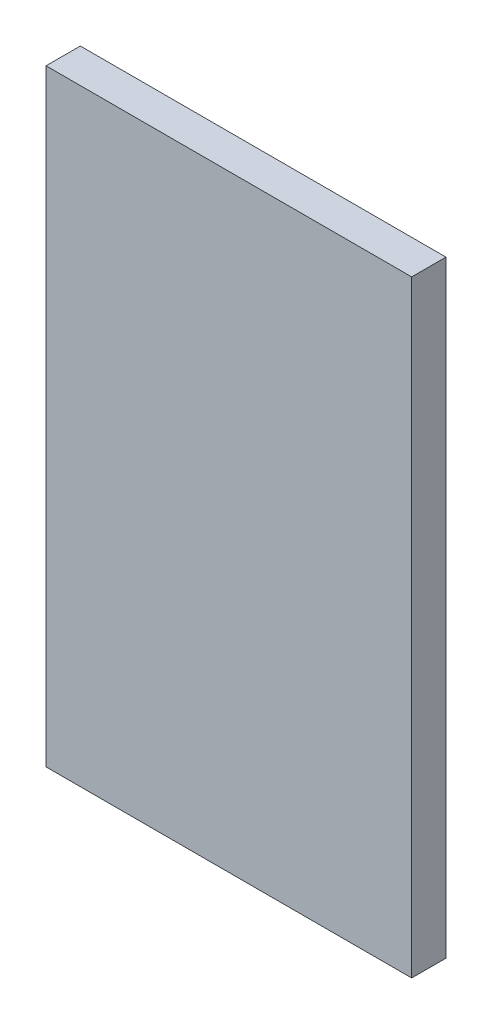
ISO-10303-21;
HEADER;
FILE_DESCRIPTION(('STEP AP214'),'2;1');
FILE_NAME('part.step','',(''),(''),'','','');
FILE_SCHEMA(('AUTOMOTIVE_DESIGN { 1 0 10303 214 1 1 1 1 }'));
ENDSEC;
DATA;
#1=APPLICATION_CONTEXT('core data for automotive mechanical design processes');
#2=APPLICATION_PROTOCOL_DEFINITION('international standard','automotive_design',2000,#1);
#3=PRODUCT_CONTEXT('',#1,'mechanical');
#4=PRODUCT('Part','Part','',(#3));
#5=PRODUCT_RELATED_PRODUCT_CATEGORY('part','',(#4));
#6=PRODUCT_DEFINITION_FORMATION('','',#4);
#7=PRODUCT_DEFINITION_CONTEXT('part definition',#1,'design');
#8=PRODUCT_DEFINITION('design','',#6,#7);
#9=PRODUCT_DEFINITION_SHAPE('','',#8);
#10=(LENGTH_UNIT() NAMED_UNIT(*) SI_UNIT(.MILLI.,.METRE.));
#11=(NAMED_UNIT(*) PLANE_ANGLE_UNIT() SI_UNIT($,.RADIAN.));
#12=(NAMED_UNIT(*) SI_UNIT($,.STERADIAN.) SOLID_ANGLE_UNIT());
#13=UNCERTAINTY_MEASURE_WITH_UNIT(LENGTH_MEASURE(1.E-05),#10,'distance_accuracy_value','');
#14=(GEOMETRIC_REPRESENTATION_CONTEXT(3) GLOBAL_UNCERTAINTY_ASSIGNED_CONTEXT((#13)) GLOBAL_UNIT_ASSIGNED_CONTEXT((#10,
#11,#12)) REPRESENTATION_CONTEXT('',''));
#15=CARTESIAN_POINT('',(0.,0.,0.));
#16=DIRECTION('',(0.,0.,1.));
#17=DIRECTION('',(1.,0.,0.));
#18=AXIS2_PLACEMENT_3D('',#15,#16,#17);
#19=CARTESIAN_POINT('',(0.,0.,2.54));
#20=DIRECTION('',(1.,0.,0.));
#21=DIRECTION('',(0.,0.,-1.));
#22=AXIS2_PLACEMENT_3D('',#19,#20,#21);
#23=PLANE('',#22);
#24=DIRECTION('',(0.,-1.,0.));
#25=VECTOR('',#24,1.);
#26=CARTESIAN_POINT('',(0.,0.,0.));
#27=LINE('',#26,#25);
#28=CARTESIAN_POINT('',(0.,45.,0.));
#29=VERTEX_POINT('',#28);
#30=CARTESIAN_POINT('',(0.,0.,0.));
#31=VERTEX_POINT('',#30);
#32=EDGE_CURVE('E96',#29,#31,#27,.T.);
#33=ORIENTED_EDGE('',*,*,#32,.T.);
#34=DIRECTION('',(0.,0.,-1.));
#35=VECTOR('',#34,1.);
#36=CARTESIAN_POINT('',(0.,0.,2.54));
#37=LINE('',#36,#35);
#38=CARTESIAN_POINT('',(0.,0.,2.54));
#39=VERTEX_POINT('',#38);
#40=EDGE_CURVE('E11',#39,#31,#37,.T.);
#41=ORIENTED_EDGE('',*,*,#40,.F.);
#42=DIRECTION('',(0.,-1.,0.));
#43=VECTOR('',#42,1.);
#44=CARTESIAN_POINT('',(0.,0.,2.54));
#45=LINE('',#44,#43);
#46=CARTESIAN_POINT('',(0.,45.,2.54));
#47=VERTEX_POINT('',#46);
#48=EDGE_CURVE('E84',#47,#39,#45,.T.);
#49=ORIENTED_EDGE('',*,*,#48,.F.);
#50=DIRECTION('',(0.,0.,-1.));
#51=VECTOR('',#50,1.);
#52=CARTESIAN_POINT('',(0.,45.,2.54));
#53=LINE('',#52,#51);
#54=EDGE_CURVE('E92',#47,#29,#53,.T.);
#55=ORIENTED_EDGE('',*,*,#54,.T.);
#56=EDGE_LOOP('',(#33,#41,#49,#55));
#57=FACE_BOUND('',#56,.T.);
#58=ADVANCED_FACE('F33',(#57),#23,.F.);
#59=CARTESIAN_POINT('',(0.,0.,2.54));
#60=DIRECTION('',(0.,1.,0.));
#61=DIRECTION('',(0.,0.,1.));
#62=AXIS2_PLACEMENT_3D('',#59,#60,#61);
#63=PLANE('',#62);
#64=DIRECTION('',(1.,0.,0.));
#65=VECTOR('',#64,1.);
#66=CARTESIAN_POINT('',(0.,0.,0.));
#67=LINE('',#66,#65);
#68=CARTESIAN_POINT('',(27.1,0.,0.));
#69=VERTEX_POINT('',#68);
#70=EDGE_CURVE('E88',#31,#69,#67,.T.);
#71=ORIENTED_EDGE('',*,*,#70,.T.);
#72=DIRECTION('',(0.,0.,-1.));
#73=VECTOR('',#72,1.);
#74=CARTESIAN_POINT('',(27.1,0.,2.54));
#75=LINE('',#74,#73);
#76=CARTESIAN_POINT('',(27.1,0.,2.54));
#77=VERTEX_POINT('',#76);
#78=EDGE_CURVE('E41',#77,#69,#75,.T.);
#79=ORIENTED_EDGE('',*,*,#78,.F.);
#80=DIRECTION('',(1.,0.,0.));
#81=VECTOR('',#80,1.);
#82=CARTESIAN_POINT('',(0.,0.,2.54));
#83=LINE('',#82,#81);
#84=EDGE_CURVE('E79',#39,#77,#83,.T.);
#85=ORIENTED_EDGE('',*,*,#84,.F.);
#86=ORIENTED_EDGE('',*,*,#40,.T.);
#87=EDGE_LOOP('',(#71,#79,#85,#86));
#88=FACE_BOUND('',#87,.T.);
#89=ADVANCED_FACE('F87',(#88),#63,.F.);
#90=CARTESIAN_POINT('',(27.1,0.,2.54));
#91=DIRECTION('',(-1.,0.,0.));
#92=DIRECTION('',(0.,0.,1.));
#93=AXIS2_PLACEMENT_3D('',#90,#91,#92);
#94=PLANE('',#93);
#95=DIRECTION('',(0.,1.,0.));
#96=VECTOR('',#95,1.);
#97=CARTESIAN_POINT('',(27.1,0.,0.));
#98=LINE('',#97,#96);
#99=CARTESIAN_POINT('',(27.1,45.,0.));
#100=VERTEX_POINT('',#99);
#101=EDGE_CURVE('E66',#69,#100,#98,.T.);
#102=ORIENTED_EDGE('',*,*,#101,.T.);
#103=DIRECTION('',(0.,0.,-1.));
#104=VECTOR('',#103,1.);
#105=CARTESIAN_POINT('',(27.1,45.,2.54));
#106=LINE('',#105,#104);
#107=CARTESIAN_POINT('',(27.1,45.,2.54));
#108=VERTEX_POINT('',#107);
#109=EDGE_CURVE('E89',#108,#100,#106,.T.);
#110=ORIENTED_EDGE('',*,*,#109,.F.);
#111=DIRECTION('',(0.,1.,0.));
#112=VECTOR('',#111,1.);
#113=CARTESIAN_POINT('',(27.1,0.,2.54));
#114=LINE('',#113,#112);
#115=EDGE_CURVE('E82',#77,#108,#114,.T.);
#116=ORIENTED_EDGE('',*,*,#115,.F.);
#117=ORIENTED_EDGE('',*,*,#78,.T.);
#118=EDGE_LOOP('',(#102,#110,#116,#117));
#119=FACE_BOUND('',#118,.T.);
#120=ADVANCED_FACE('F90',(#119),#94,.F.);
#121=CARTESIAN_POINT('',(0.,45.,2.54));
#122=DIRECTION('',(0.,-1.,0.));
#123=DIRECTION('',(0.,0.,-1.));
#124=AXIS2_PLACEMENT_3D('',#121,#122,#123);
#125=PLANE('',#124);
#126=DIRECTION('',(-1.,0.,0.));
#127=VECTOR('',#126,1.);
#128=CARTESIAN_POINT('',(0.,45.,0.));
#129=LINE('',#128,#127);
#130=EDGE_CURVE('E72',#100,#29,#129,.T.);
#131=ORIENTED_EDGE('',*,*,#130,.T.);
#132=ORIENTED_EDGE('',*,*,#54,.F.);
#133=DIRECTION('',(-1.,0.,0.));
#134=VECTOR('',#133,1.);
#135=CARTESIAN_POINT('',(0.,45.,2.54));
#136=LINE('',#135,#134);
#137=EDGE_CURVE('E49',#108,#47,#136,.T.);
#138=ORIENTED_EDGE('',*,*,#137,.F.);
#139=ORIENTED_EDGE('',*,*,#109,.T.);
#140=EDGE_LOOP('',(#131,#132,#138,#139));
#141=FACE_BOUND('',#140,.T.);
#142=ADVANCED_FACE('F103',(#141),#125,.F.);
#143=CARTESIAN_POINT('',(0.,0.,2.54));
#144=DIRECTION('',(0.,0.,-1.));
#145=DIRECTION('',(-1.,0.,0.));
#146=AXIS2_PLACEMENT_3D('',#143,#144,#145);
#147=PLANE('',#146);
#148=ORIENTED_EDGE('',*,*,#48,.T.);
#149=ORIENTED_EDGE('',*,*,#84,.T.);
#150=ORIENTED_EDGE('',*,*,#115,.T.);
#151=ORIENTED_EDGE('',*,*,#137,.T.);
#152=EDGE_LOOP('',(#148,#149,#150,#151));
#153=FACE_BOUND('',#152,.T.);
#154=ADVANCED_FACE('F80',(#153),#147,.F.);
#155=CARTESIAN_POINT('',(0.,0.,0.));
#156=DIRECTION('',(0.,0.,-1.));
#157=DIRECTION('',(-1.,0.,0.));
#158=AXIS2_PLACEMENT_3D('',#155,#156,#157);
#159=PLANE('',#158);
#160=ORIENTED_EDGE('',*,*,#32,.F.);
#161=ORIENTED_EDGE('',*,*,#130,.F.);
#162=ORIENTED_EDGE('',*,*,#101,.F.);
#163=ORIENTED_EDGE('',*,*,#70,.F.);
#164=EDGE_LOOP('',(#160,#161,#162,#163));
#165=FACE_BOUND('',#164,.T.);
#166=ADVANCED_FACE('F106',(#165),#159,.T.);
#167=CLOSED_SHELL('',(#58,#89,#120,#142,#154,#166));
#168=MANIFOLD_SOLID_BREP('B2',#167);
#169=ADVANCED_BREP_SHAPE_REPRESENTATION('',(#18,#168),#14);
#170=SHAPE_DEFINITION_REPRESENTATION(#9,#169);
ENDSEC;
END-ISO-10303-21;
